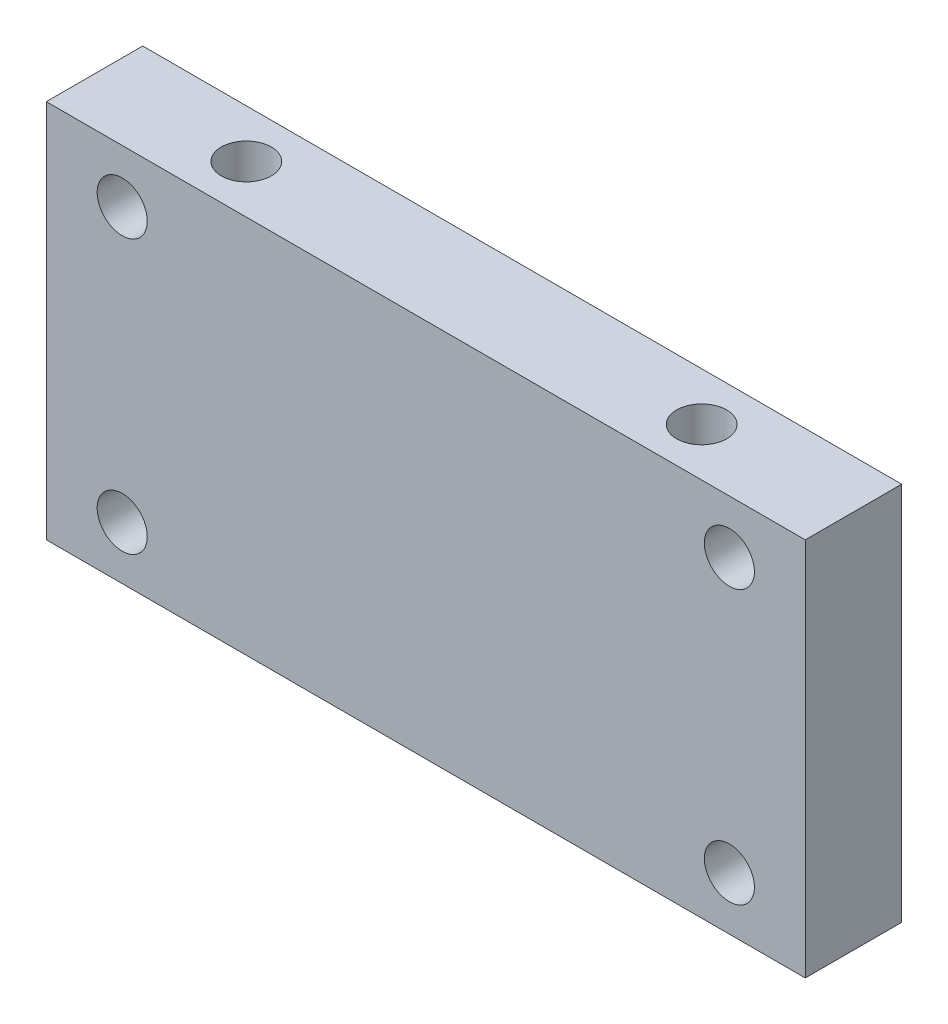
ISO-10303-21;
HEADER;
FILE_DESCRIPTION(('STEP AP214'),'2;1');
FILE_NAME('part.step','',(''),(''),'','','');
FILE_SCHEMA(('AUTOMOTIVE_DESIGN { 1 0 10303 214 1 1 1 1 }'));
ENDSEC;
DATA;
#1=APPLICATION_CONTEXT('core data for automotive mechanical design processes');
#2=APPLICATION_PROTOCOL_DEFINITION('international standard','automotive_design',2000,#1);
#3=PRODUCT_CONTEXT('',#1,'mechanical');
#4=PRODUCT('Part','Part','',(#3));
#5=PRODUCT_RELATED_PRODUCT_CATEGORY('part','',(#4));
#6=PRODUCT_DEFINITION_FORMATION('','',#4);
#7=PRODUCT_DEFINITION_CONTEXT('part definition',#1,'design');
#8=PRODUCT_DEFINITION('design','',#6,#7);
#9=PRODUCT_DEFINITION_SHAPE('','',#8);
#10=(LENGTH_UNIT() NAMED_UNIT(*) SI_UNIT(.MILLI.,.METRE.));
#11=(NAMED_UNIT(*) PLANE_ANGLE_UNIT() SI_UNIT($,.RADIAN.));
#12=(NAMED_UNIT(*) SI_UNIT($,.STERADIAN.) SOLID_ANGLE_UNIT());
#13=UNCERTAINTY_MEASURE_WITH_UNIT(LENGTH_MEASURE(1.E-05),#10,'distance_accuracy_value','');
#14=(GEOMETRIC_REPRESENTATION_CONTEXT(3) GLOBAL_UNCERTAINTY_ASSIGNED_CONTEXT((#13)) GLOBAL_UNIT_ASSIGNED_CONTEXT((#10,
#11,#12)) REPRESENTATION_CONTEXT('',''));
#15=CARTESIAN_POINT('',(0.,0.,0.));
#16=DIRECTION('',(0.,0.,1.));
#17=DIRECTION('',(1.,0.,0.));
#18=AXIS2_PLACEMENT_3D('',#15,#16,#17);
#19=CARTESIAN_POINT('',(0.,25.,0.));
#20=DIRECTION('',(1.,0.,0.));
#21=DIRECTION('',(0.,0.,-1.));
#22=AXIS2_PLACEMENT_3D('',#19,#20,#21);
#23=PLANE('',#22);
#24=DIRECTION('',(0.,0.,1.));
#25=VECTOR('',#24,1.);
#26=CARTESIAN_POINT('',(0.,0.,0.));
#27=LINE('',#26,#25);
#28=CARTESIAN_POINT('',(0.,0.,-6.35));
#29=VERTEX_POINT('',#28);
#30=CARTESIAN_POINT('',(0.,0.,0.));
#31=VERTEX_POINT('',#30);
#32=EDGE_CURVE('E115',#29,#31,#27,.T.);
#33=ORIENTED_EDGE('',*,*,#32,.T.);
#34=DIRECTION('',(0.,-1.,0.));
#35=VECTOR('',#34,1.);
#36=CARTESIAN_POINT('',(0.,25.,0.));
#37=LINE('',#36,#35);
#38=CARTESIAN_POINT('',(0.,25.,0.));
#39=VERTEX_POINT('',#38);
#40=EDGE_CURVE('E11',#39,#31,#37,.T.);
#41=ORIENTED_EDGE('',*,*,#40,.F.);
#42=DIRECTION('',(0.,0.,1.));
#43=VECTOR('',#42,1.);
#44=CARTESIAN_POINT('',(0.,25.,0.));
#45=LINE('',#44,#43);
#46=CARTESIAN_POINT('',(0.,25.,-6.35));
#47=VERTEX_POINT('',#46);
#48=EDGE_CURVE('E116',#47,#39,#45,.T.);
#49=ORIENTED_EDGE('',*,*,#48,.F.);
#50=DIRECTION('',(0.,-1.,0.));
#51=VECTOR('',#50,1.);
#52=CARTESIAN_POINT('',(0.,25.,-6.35));
#53=LINE('',#52,#51);
#54=EDGE_CURVE('E122',#47,#29,#53,.T.);
#55=ORIENTED_EDGE('',*,*,#54,.T.);
#56=EDGE_LOOP('',(#33,#41,#49,#55));
#57=FACE_BOUND('',#56,.T.);
#58=ADVANCED_FACE('F36',(#57),#23,.F.);
#59=CARTESIAN_POINT('',(0.,25.,0.));
#60=DIRECTION('',(0.,0.,-1.));
#61=DIRECTION('',(-1.,0.,0.));
#62=AXIS2_PLACEMENT_3D('',#59,#60,#61);
#63=PLANE('',#62);
#64=CARTESIAN_POINT('',(5.,21.5,0.));
#65=DIRECTION('',(0.,0.,1.));
#66=DIRECTION('',(1.,0.,0.));
#67=AXIS2_PLACEMENT_3D('',#64,#65,#66);
#68=CIRCLE('',#67,1.64999999999999);
#69=CARTESIAN_POINT('',(6.64999999999999,21.5,0.));
#70=VERTEX_POINT('',#69);
#71=EDGE_CURVE('E152',#70,#70,#68,.T.);
#72=ORIENTED_EDGE('',*,*,#71,.F.);
#73=EDGE_LOOP('',(#72));
#74=FACE_BOUND('',#73,.T.);
#75=CARTESIAN_POINT('',(45.,21.5,0.));
#76=DIRECTION('',(0.,0.,1.));
#77=DIRECTION('',(1.,0.,0.));
#78=AXIS2_PLACEMENT_3D('',#75,#76,#77);
#79=CIRCLE('',#78,1.64999999999999);
#80=CARTESIAN_POINT('',(46.65,21.5,0.));
#81=VERTEX_POINT('',#80);
#82=EDGE_CURVE('E147',#81,#81,#79,.T.);
#83=ORIENTED_EDGE('',*,*,#82,.F.);
#84=EDGE_LOOP('',(#83));
#85=FACE_BOUND('',#84,.T.);
#86=CARTESIAN_POINT('',(45.,3.5,0.));
#87=DIRECTION('',(0.,0.,1.));
#88=DIRECTION('',(1.,0.,0.));
#89=AXIS2_PLACEMENT_3D('',#86,#87,#88);
#90=CIRCLE('',#89,1.64999999999999);
#91=CARTESIAN_POINT('',(46.65,3.5,0.));
#92=VERTEX_POINT('',#91);
#93=EDGE_CURVE('E137',#92,#92,#90,.T.);
#94=ORIENTED_EDGE('',*,*,#93,.F.);
#95=EDGE_LOOP('',(#94));
#96=FACE_BOUND('',#95,.T.);
#97=CARTESIAN_POINT('',(5.,3.5,0.));
#98=DIRECTION('',(0.,0.,1.));
#99=DIRECTION('',(1.,0.,0.));
#100=AXIS2_PLACEMENT_3D('',#97,#98,#99);
#101=CIRCLE('',#100,1.64999999999999);
#102=CARTESIAN_POINT('',(6.64999999999999,3.5,0.));
#103=VERTEX_POINT('',#102);
#104=EDGE_CURVE('E134',#103,#103,#101,.T.);
#105=ORIENTED_EDGE('',*,*,#104,.F.);
#106=EDGE_LOOP('',(#105));
#107=FACE_BOUND('',#106,.T.);
#108=DIRECTION('',(1.,0.,0.));
#109=VECTOR('',#108,1.);
#110=CARTESIAN_POINT('',(0.,0.,0.));
#111=LINE('',#110,#109);
#112=CARTESIAN_POINT('',(50.,0.,0.));
#113=VERTEX_POINT('',#112);
#114=EDGE_CURVE('E125',#31,#113,#111,.T.);
#115=ORIENTED_EDGE('',*,*,#114,.T.);
#116=DIRECTION('',(0.,-1.,0.));
#117=VECTOR('',#116,1.);
#118=CARTESIAN_POINT('',(50.,25.,0.));
#119=LINE('',#118,#117);
#120=CARTESIAN_POINT('',(50.,25.,0.));
#121=VERTEX_POINT('',#120);
#122=EDGE_CURVE('E45',#121,#113,#119,.T.);
#123=ORIENTED_EDGE('',*,*,#122,.F.);
#124=DIRECTION('',(1.,0.,0.));
#125=VECTOR('',#124,1.);
#126=CARTESIAN_POINT('',(0.,25.,0.));
#127=LINE('',#126,#125);
#128=EDGE_CURVE('E85',#39,#121,#127,.T.);
#129=ORIENTED_EDGE('',*,*,#128,.F.);
#130=ORIENTED_EDGE('',*,*,#40,.T.);
#131=EDGE_LOOP('',(#115,#123,#129,#130));
#132=FACE_BOUND('',#131,.T.);
#133=ADVANCED_FACE('F173',(#74,#85,#96,#107,#132),#63,.F.);
#134=CARTESIAN_POINT('',(50.,25.,0.));
#135=DIRECTION('',(-1.,0.,0.));
#136=DIRECTION('',(0.,0.,1.));
#137=AXIS2_PLACEMENT_3D('',#134,#135,#136);
#138=PLANE('',#137);
#139=DIRECTION('',(0.,0.,-1.));
#140=VECTOR('',#139,1.);
#141=CARTESIAN_POINT('',(50.,0.,0.));
#142=LINE('',#141,#140);
#143=CARTESIAN_POINT('',(50.,0.,-6.35));
#144=VERTEX_POINT('',#143);
#145=EDGE_CURVE('E72',#113,#144,#142,.T.);
#146=ORIENTED_EDGE('',*,*,#145,.T.);
#147=DIRECTION('',(0.,-1.,0.));
#148=VECTOR('',#147,1.);
#149=CARTESIAN_POINT('',(50.,25.,-6.35));
#150=LINE('',#149,#148);
#151=CARTESIAN_POINT('',(50.,25.,-6.35));
#152=VERTEX_POINT('',#151);
#153=EDGE_CURVE('E130',#152,#144,#150,.T.);
#154=ORIENTED_EDGE('',*,*,#153,.F.);
#155=DIRECTION('',(0.,0.,-1.));
#156=VECTOR('',#155,1.);
#157=CARTESIAN_POINT('',(50.,25.,0.));
#158=LINE('',#157,#156);
#159=EDGE_CURVE('E119',#121,#152,#158,.T.);
#160=ORIENTED_EDGE('',*,*,#159,.F.);
#161=ORIENTED_EDGE('',*,*,#122,.T.);
#162=EDGE_LOOP('',(#146,#154,#160,#161));
#163=FACE_BOUND('',#162,.T.);
#164=ADVANCED_FACE('F178',(#163),#138,.F.);
#165=CARTESIAN_POINT('',(0.,25.,-6.35));
#166=DIRECTION('',(0.,0.,1.));
#167=DIRECTION('',(1.,0.,0.));
#168=AXIS2_PLACEMENT_3D('',#165,#166,#167);
#169=PLANE('',#168);
#170=CARTESIAN_POINT('',(5.,21.5,-6.35));
#171=DIRECTION('',(0.,0.,1.));
#172=DIRECTION('',(1.,0.,0.));
#173=AXIS2_PLACEMENT_3D('',#170,#171,#172);
#174=CIRCLE('',#173,1.64999999999999);
#175=CARTESIAN_POINT('',(6.64999999999999,21.5,-6.35));
#176=VERTEX_POINT('',#175);
#177=EDGE_CURVE('E39',#176,#176,#174,.T.);
#178=ORIENTED_EDGE('',*,*,#177,.T.);
#179=EDGE_LOOP('',(#178));
#180=FACE_BOUND('',#179,.T.);
#181=CARTESIAN_POINT('',(45.,21.5,-6.35));
#182=DIRECTION('',(0.,0.,1.));
#183=DIRECTION('',(1.,0.,0.));
#184=AXIS2_PLACEMENT_3D('',#181,#182,#183);
#185=CIRCLE('',#184,1.64999999999999);
#186=CARTESIAN_POINT('',(46.65,21.5,-6.35));
#187=VERTEX_POINT('',#186);
#188=EDGE_CURVE('E142',#187,#187,#185,.T.);
#189=ORIENTED_EDGE('',*,*,#188,.T.);
#190=EDGE_LOOP('',(#189));
#191=FACE_BOUND('',#190,.T.);
#192=CARTESIAN_POINT('',(45.,3.5,-6.35));
#193=DIRECTION('',(0.,0.,1.));
#194=DIRECTION('',(1.,0.,0.));
#195=AXIS2_PLACEMENT_3D('',#192,#193,#194);
#196=CIRCLE('',#195,1.64999999999999);
#197=CARTESIAN_POINT('',(46.65,3.5,-6.35));
#198=VERTEX_POINT('',#197);
#199=EDGE_CURVE('E135',#198,#198,#196,.T.);
#200=ORIENTED_EDGE('',*,*,#199,.T.);
#201=EDGE_LOOP('',(#200));
#202=FACE_BOUND('',#201,.T.);
#203=CARTESIAN_POINT('',(5.,3.5,-6.35));
#204=DIRECTION('',(0.,0.,1.));
#205=DIRECTION('',(1.,0.,0.));
#206=AXIS2_PLACEMENT_3D('',#203,#204,#205);
#207=CIRCLE('',#206,1.64999999999999);
#208=CARTESIAN_POINT('',(6.64999999999999,3.5,-6.35));
#209=VERTEX_POINT('',#208);
#210=EDGE_CURVE('E109',#209,#209,#207,.T.);
#211=ORIENTED_EDGE('',*,*,#210,.T.);
#212=EDGE_LOOP('',(#211));
#213=FACE_BOUND('',#212,.T.);
#214=DIRECTION('',(-1.,0.,0.));
#215=VECTOR('',#214,1.);
#216=CARTESIAN_POINT('',(0.,0.,-6.35));
#217=LINE('',#216,#215);
#218=EDGE_CURVE('E78',#144,#29,#217,.T.);
#219=ORIENTED_EDGE('',*,*,#218,.T.);
#220=ORIENTED_EDGE('',*,*,#54,.F.);
#221=DIRECTION('',(-1.,0.,0.));
#222=VECTOR('',#221,1.);
#223=CARTESIAN_POINT('',(0.,25.,-6.35));
#224=LINE('',#223,#222);
#225=EDGE_CURVE('E54',#152,#47,#224,.T.);
#226=ORIENTED_EDGE('',*,*,#225,.F.);
#227=ORIENTED_EDGE('',*,*,#153,.T.);
#228=EDGE_LOOP('',(#219,#220,#226,#227));
#229=FACE_BOUND('',#228,.T.);
#230=ADVANCED_FACE('F159',(#180,#191,#202,#213,#229),#169,.F.);
#231=CARTESIAN_POINT('',(0.,25.,0.));
#232=DIRECTION('',(0.,-1.,0.));
#233=DIRECTION('',(0.,0.,-1.));
#234=AXIS2_PLACEMENT_3D('',#231,#232,#233);
#235=PLANE('',#234);
#236=CARTESIAN_POINT('',(40.,25.,-3.175));
#237=DIRECTION('',(0.,1.,0.));
#238=DIRECTION('',(0.,0.,1.));
#239=AXIS2_PLACEMENT_3D('',#236,#237,#238);
#240=CIRCLE('',#239,1.64999999999999);
#241=CARTESIAN_POINT('',(40.,25.,-1.52500000000001));
#242=VERTEX_POINT('',#241);
#243=EDGE_CURVE('E103',#242,#242,#240,.T.);
#244=ORIENTED_EDGE('',*,*,#243,.F.);
#245=EDGE_LOOP('',(#244));
#246=FACE_BOUND('',#245,.T.);
#247=CARTESIAN_POINT('',(10.,25.,-3.175));
#248=DIRECTION('',(0.,1.,0.));
#249=DIRECTION('',(0.,0.,1.));
#250=AXIS2_PLACEMENT_3D('',#247,#248,#249);
#251=CIRCLE('',#250,1.64999999999999);
#252=CARTESIAN_POINT('',(10.,25.,-1.52500000000001));
#253=VERTEX_POINT('',#252);
#254=EDGE_CURVE('E102',#253,#253,#251,.T.);
#255=ORIENTED_EDGE('',*,*,#254,.F.);
#256=EDGE_LOOP('',(#255));
#257=FACE_BOUND('',#256,.T.);
#258=ORIENTED_EDGE('',*,*,#48,.T.);
#259=ORIENTED_EDGE('',*,*,#128,.T.);
#260=ORIENTED_EDGE('',*,*,#159,.T.);
#261=ORIENTED_EDGE('',*,*,#225,.T.);
#262=EDGE_LOOP('',(#258,#259,#260,#261));
#263=FACE_BOUND('',#262,.T.);
#264=ADVANCED_FACE('F186',(#246,#257,#263),#235,.F.);
#265=CARTESIAN_POINT('',(0.,0.,0.));
#266=DIRECTION('',(0.,-1.,0.));
#267=DIRECTION('',(0.,0.,-1.));
#268=AXIS2_PLACEMENT_3D('',#265,#266,#267);
#269=PLANE('',#268);
#270=ORIENTED_EDGE('',*,*,#32,.F.);
#271=ORIENTED_EDGE('',*,*,#218,.F.);
#272=ORIENTED_EDGE('',*,*,#145,.F.);
#273=ORIENTED_EDGE('',*,*,#114,.F.);
#274=EDGE_LOOP('',(#270,#271,#272,#273));
#275=FACE_BOUND('',#274,.T.);
#276=ADVANCED_FACE('F184',(#275),#269,.T.);
#277=CARTESIAN_POINT('',(10.,14.9,-3.175));
#278=DIRECTION('',(0.,1.,0.));
#279=DIRECTION('',(0.,0.,1.));
#280=AXIS2_PLACEMENT_3D('',#277,#278,#279);
#281=CONICAL_SURFACE('',#280,1.64999999999999,1.02974425867665);
#282=CARTESIAN_POINT('',(10.,13.9085799786045,-3.175));
#283=VERTEX_POINT('',#282);
#284=VERTEX_LOOP('',#283);
#285=FACE_BOUND('',#284,.T.);
#286=CARTESIAN_POINT('',(10.,14.9,-3.175));
#287=DIRECTION('',(0.,1.,0.));
#288=DIRECTION('',(0.,0.,1.));
#289=AXIS2_PLACEMENT_3D('',#286,#287,#288);
#290=CIRCLE('',#289,1.64999999999999);
#291=CARTESIAN_POINT('',(10.,14.9,-1.52500000000001));
#292=VERTEX_POINT('',#291);
#293=EDGE_CURVE('E106',#292,#292,#290,.T.);
#294=ORIENTED_EDGE('',*,*,#293,.T.);
#295=EDGE_LOOP('',(#294));
#296=FACE_BOUND('',#295,.T.);
#297=ADVANCED_FACE('F194',(#285,#296),#281,.F.);
#298=CARTESIAN_POINT('',(10.,25.,-3.175));
#299=DIRECTION('',(0.,1.,0.));
#300=DIRECTION('',(0.,0.,1.));
#301=AXIS2_PLACEMENT_3D('',#298,#299,#300);
#302=CYLINDRICAL_SURFACE('',#301,1.64999999999999);
#303=ORIENTED_EDGE('',*,*,#293,.F.);
#304=EDGE_LOOP('',(#303));
#305=FACE_BOUND('',#304,.T.);
#306=ORIENTED_EDGE('',*,*,#254,.T.);
#307=EDGE_LOOP('',(#306));
#308=FACE_BOUND('',#307,.T.);
#309=ADVANCED_FACE('F96',(#305,#308),#302,.F.);
#310=CARTESIAN_POINT('',(40.,14.9,-3.175));
#311=DIRECTION('',(0.,1.,0.));
#312=DIRECTION('',(0.,0.,1.));
#313=AXIS2_PLACEMENT_3D('',#310,#311,#312);
#314=CONICAL_SURFACE('',#313,1.64999999999999,1.02974425867665);
#315=CARTESIAN_POINT('',(40.,13.9085799786045,-3.175));
#316=VERTEX_POINT('',#315);
#317=VERTEX_LOOP('',#316);
#318=FACE_BOUND('',#317,.T.);
#319=CARTESIAN_POINT('',(40.,14.9,-3.175));
#320=DIRECTION('',(0.,1.,0.));
#321=DIRECTION('',(0.,0.,1.));
#322=AXIS2_PLACEMENT_3D('',#319,#320,#321);
#323=CIRCLE('',#322,1.64999999999999);
#324=CARTESIAN_POINT('',(40.,14.9,-1.52500000000001));
#325=VERTEX_POINT('',#324);
#326=EDGE_CURVE('E100',#325,#325,#323,.T.);
#327=ORIENTED_EDGE('',*,*,#326,.T.);
#328=EDGE_LOOP('',(#327));
#329=FACE_BOUND('',#328,.T.);
#330=ADVANCED_FACE('F92',(#318,#329),#314,.F.);
#331=CARTESIAN_POINT('',(40.,25.,-3.175));
#332=DIRECTION('',(0.,1.,0.));
#333=DIRECTION('',(0.,0.,1.));
#334=AXIS2_PLACEMENT_3D('',#331,#332,#333);
#335=CYLINDRICAL_SURFACE('',#334,1.64999999999999);
#336=ORIENTED_EDGE('',*,*,#326,.F.);
#337=EDGE_LOOP('',(#336));
#338=FACE_BOUND('',#337,.T.);
#339=ORIENTED_EDGE('',*,*,#243,.T.);
#340=EDGE_LOOP('',(#339));
#341=FACE_BOUND('',#340,.T.);
#342=ADVANCED_FACE('F95',(#338,#341),#335,.F.);
#343=CARTESIAN_POINT('',(5.,3.5,0.));
#344=DIRECTION('',(0.,0.,1.));
#345=DIRECTION('',(1.,0.,0.));
#346=AXIS2_PLACEMENT_3D('',#343,#344,#345);
#347=CYLINDRICAL_SURFACE('',#346,1.64999999999999);
#348=ORIENTED_EDGE('',*,*,#104,.T.);
#349=EDGE_LOOP('',(#348));
#350=FACE_BOUND('',#349,.T.);
#351=ORIENTED_EDGE('',*,*,#210,.F.);
#352=EDGE_LOOP('',(#351));
#353=FACE_BOUND('',#352,.T.);
#354=ADVANCED_FACE('F221',(#350,#353),#347,.F.);
#355=CARTESIAN_POINT('',(45.,3.5,0.));
#356=DIRECTION('',(0.,0.,1.));
#357=DIRECTION('',(1.,0.,0.));
#358=AXIS2_PLACEMENT_3D('',#355,#356,#357);
#359=CYLINDRICAL_SURFACE('',#358,1.64999999999999);
#360=ORIENTED_EDGE('',*,*,#93,.T.);
#361=EDGE_LOOP('',(#360));
#362=FACE_BOUND('',#361,.T.);
#363=ORIENTED_EDGE('',*,*,#199,.F.);
#364=EDGE_LOOP('',(#363));
#365=FACE_BOUND('',#364,.T.);
#366=ADVANCED_FACE('F169',(#362,#365),#359,.F.);
#367=CARTESIAN_POINT('',(45.,21.5,0.));
#368=DIRECTION('',(0.,0.,1.));
#369=DIRECTION('',(1.,0.,0.));
#370=AXIS2_PLACEMENT_3D('',#367,#368,#369);
#371=CYLINDRICAL_SURFACE('',#370,1.64999999999999);
#372=ORIENTED_EDGE('',*,*,#82,.T.);
#373=EDGE_LOOP('',(#372));
#374=FACE_BOUND('',#373,.T.);
#375=ORIENTED_EDGE('',*,*,#188,.F.);
#376=EDGE_LOOP('',(#375));
#377=FACE_BOUND('',#376,.T.);
#378=ADVANCED_FACE('F164',(#374,#377),#371,.F.);
#379=CARTESIAN_POINT('',(5.,21.5,0.));
#380=DIRECTION('',(0.,0.,1.));
#381=DIRECTION('',(1.,0.,0.));
#382=AXIS2_PLACEMENT_3D('',#379,#380,#381);
#383=CYLINDRICAL_SURFACE('',#382,1.64999999999999);
#384=ORIENTED_EDGE('',*,*,#71,.T.);
#385=EDGE_LOOP('',(#384));
#386=FACE_BOUND('',#385,.T.);
#387=ORIENTED_EDGE('',*,*,#177,.F.);
#388=EDGE_LOOP('',(#387));
#389=FACE_BOUND('',#388,.T.);
#390=ADVANCED_FACE('F162',(#386,#389),#383,.F.);
#391=CLOSED_SHELL('',(#58,#133,#164,#230,#264,#276,#297,#309,#330,#342,#354,#366,#378,#390));
#392=MANIFOLD_SOLID_BREP('B2',#391);
#393=ADVANCED_BREP_SHAPE_REPRESENTATION('',(#18,#392),#14);
#394=SHAPE_DEFINITION_REPRESENTATION(#9,#393);
ENDSEC;
END-ISO-10303-21;
